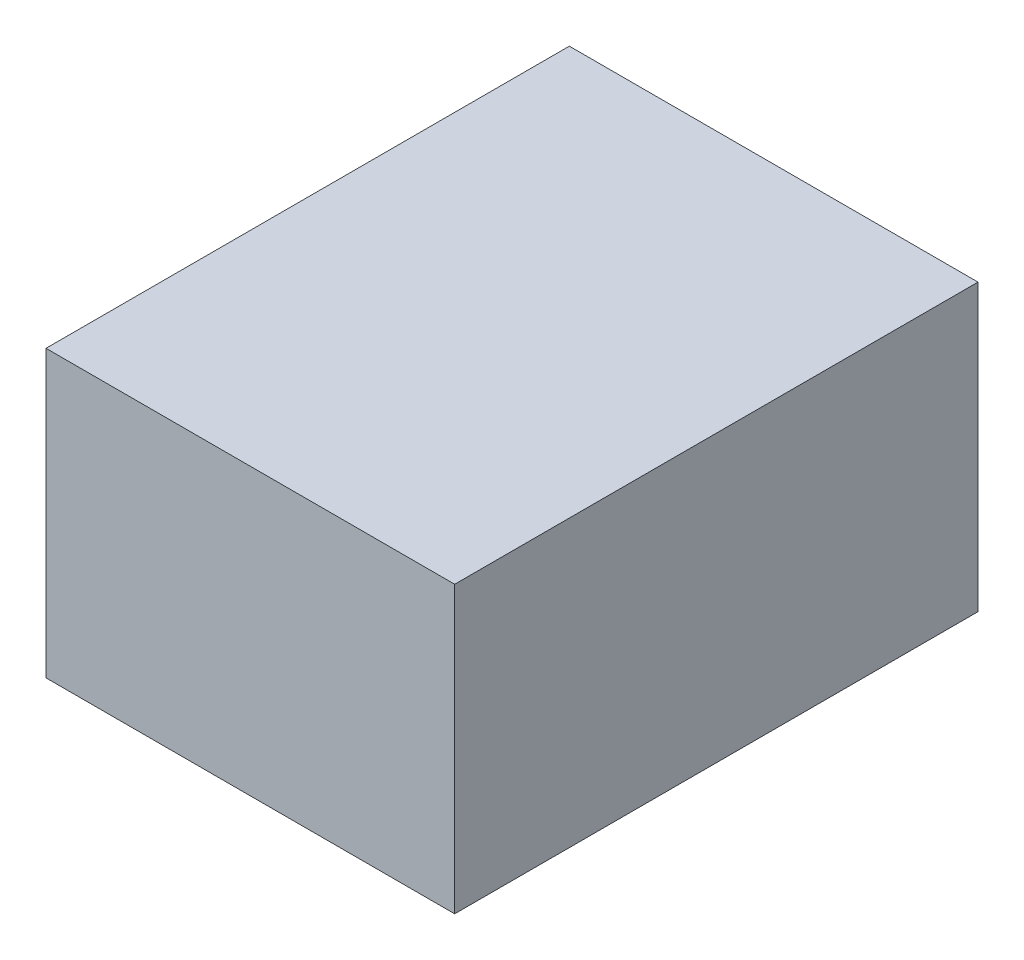
ISO-10303-21;
HEADER;
FILE_DESCRIPTION(('STEP AP214'),'2;1');
FILE_NAME('part.step','',(''),(''),'','','');
FILE_SCHEMA(('AUTOMOTIVE_DESIGN { 1 0 10303 214 1 1 1 1 }'));
ENDSEC;
DATA;
#1=APPLICATION_CONTEXT('core data for automotive mechanical design processes');
#2=APPLICATION_PROTOCOL_DEFINITION('international standard','automotive_design',2000,#1);
#3=PRODUCT_CONTEXT('',#1,'mechanical');
#4=PRODUCT('Part','Part','',(#3));
#5=PRODUCT_RELATED_PRODUCT_CATEGORY('part','',(#4));
#6=PRODUCT_DEFINITION_FORMATION('','',#4);
#7=PRODUCT_DEFINITION_CONTEXT('part definition',#1,'design');
#8=PRODUCT_DEFINITION('design','',#6,#7);
#9=PRODUCT_DEFINITION_SHAPE('','',#8);
#10=(LENGTH_UNIT() NAMED_UNIT(*) SI_UNIT(.MILLI.,.METRE.));
#11=(NAMED_UNIT(*) PLANE_ANGLE_UNIT() SI_UNIT($,.RADIAN.));
#12=(NAMED_UNIT(*) SI_UNIT($,.STERADIAN.) SOLID_ANGLE_UNIT());
#13=UNCERTAINTY_MEASURE_WITH_UNIT(LENGTH_MEASURE(1.E-05),#10,'distance_accuracy_value','');
#14=(GEOMETRIC_REPRESENTATION_CONTEXT(3) GLOBAL_UNCERTAINTY_ASSIGNED_CONTEXT((#13)) GLOBAL_UNIT_ASSIGNED_CONTEXT((#10,
#11,#12)) REPRESENTATION_CONTEXT('',''));
#15=CARTESIAN_POINT('',(0.,0.,0.));
#16=DIRECTION('',(0.,0.,1.));
#17=DIRECTION('',(1.,0.,0.));
#18=AXIS2_PLACEMENT_3D('',#15,#16,#17);
#19=CARTESIAN_POINT('',(0.,0.,22.));
#20=DIRECTION('',(1.,0.,0.));
#21=DIRECTION('',(0.,0.,-1.));
#22=AXIS2_PLACEMENT_3D('',#19,#20,#21);
#23=PLANE('',#22);
#24=DIRECTION('',(0.,-1.,0.));
#25=VECTOR('',#24,1.);
#26=CARTESIAN_POINT('',(0.,0.,0.));
#27=LINE('',#26,#25);
#28=CARTESIAN_POINT('',(0.,12.,0.));
#29=VERTEX_POINT('',#28);
#30=CARTESIAN_POINT('',(0.,0.,0.));
#31=VERTEX_POINT('',#30);
#32=EDGE_CURVE('E96',#29,#31,#27,.T.);
#33=ORIENTED_EDGE('',*,*,#32,.T.);
#34=DIRECTION('',(0.,0.,-1.));
#35=VECTOR('',#34,1.);
#36=CARTESIAN_POINT('',(0.,0.,22.));
#37=LINE('',#36,#35);
#38=CARTESIAN_POINT('',(0.,0.,22.));
#39=VERTEX_POINT('',#38);
#40=EDGE_CURVE('E11',#39,#31,#37,.T.);
#41=ORIENTED_EDGE('',*,*,#40,.F.);
#42=DIRECTION('',(0.,-1.,0.));
#43=VECTOR('',#42,1.);
#44=CARTESIAN_POINT('',(0.,0.,22.));
#45=LINE('',#44,#43);
#46=CARTESIAN_POINT('',(0.,12.,22.));
#47=VERTEX_POINT('',#46);
#48=EDGE_CURVE('E84',#47,#39,#45,.T.);
#49=ORIENTED_EDGE('',*,*,#48,.F.);
#50=DIRECTION('',(0.,0.,-1.));
#51=VECTOR('',#50,1.);
#52=CARTESIAN_POINT('',(0.,12.,22.));
#53=LINE('',#52,#51);
#54=EDGE_CURVE('E92',#47,#29,#53,.T.);
#55=ORIENTED_EDGE('',*,*,#54,.T.);
#56=EDGE_LOOP('',(#33,#41,#49,#55));
#57=FACE_BOUND('',#56,.T.);
#58=ADVANCED_FACE('F33',(#57),#23,.F.);
#59=CARTESIAN_POINT('',(0.,0.,22.));
#60=DIRECTION('',(0.,1.,0.));
#61=DIRECTION('',(0.,0.,1.));
#62=AXIS2_PLACEMENT_3D('',#59,#60,#61);
#63=PLANE('',#62);
#64=DIRECTION('',(1.,0.,0.));
#65=VECTOR('',#64,1.);
#66=CARTESIAN_POINT('',(0.,0.,0.));
#67=LINE('',#66,#65);
#68=CARTESIAN_POINT('',(17.18,0.,0.));
#69=VERTEX_POINT('',#68);
#70=EDGE_CURVE('E88',#31,#69,#67,.T.);
#71=ORIENTED_EDGE('',*,*,#70,.T.);
#72=DIRECTION('',(0.,0.,-1.));
#73=VECTOR('',#72,1.);
#74=CARTESIAN_POINT('',(17.18,0.,22.));
#75=LINE('',#74,#73);
#76=CARTESIAN_POINT('',(17.18,0.,22.));
#77=VERTEX_POINT('',#76);
#78=EDGE_CURVE('E41',#77,#69,#75,.T.);
#79=ORIENTED_EDGE('',*,*,#78,.F.);
#80=DIRECTION('',(1.,0.,0.));
#81=VECTOR('',#80,1.);
#82=CARTESIAN_POINT('',(0.,0.,22.));
#83=LINE('',#82,#81);
#84=EDGE_CURVE('E79',#39,#77,#83,.T.);
#85=ORIENTED_EDGE('',*,*,#84,.F.);
#86=ORIENTED_EDGE('',*,*,#40,.T.);
#87=EDGE_LOOP('',(#71,#79,#85,#86));
#88=FACE_BOUND('',#87,.T.);
#89=ADVANCED_FACE('F87',(#88),#63,.F.);
#90=CARTESIAN_POINT('',(17.18,0.,22.));
#91=DIRECTION('',(-1.,0.,0.));
#92=DIRECTION('',(0.,0.,1.));
#93=AXIS2_PLACEMENT_3D('',#90,#91,#92);
#94=PLANE('',#93);
#95=DIRECTION('',(0.,1.,0.));
#96=VECTOR('',#95,1.);
#97=CARTESIAN_POINT('',(17.18,0.,0.));
#98=LINE('',#97,#96);
#99=CARTESIAN_POINT('',(17.18,12.,0.));
#100=VERTEX_POINT('',#99);
#101=EDGE_CURVE('E66',#69,#100,#98,.T.);
#102=ORIENTED_EDGE('',*,*,#101,.T.);
#103=DIRECTION('',(0.,0.,-1.));
#104=VECTOR('',#103,1.);
#105=CARTESIAN_POINT('',(17.18,12.,22.));
#106=LINE('',#105,#104);
#107=CARTESIAN_POINT('',(17.18,12.,22.));
#108=VERTEX_POINT('',#107);
#109=EDGE_CURVE('E89',#108,#100,#106,.T.);
#110=ORIENTED_EDGE('',*,*,#109,.F.);
#111=DIRECTION('',(0.,1.,0.));
#112=VECTOR('',#111,1.);
#113=CARTESIAN_POINT('',(17.18,0.,22.));
#114=LINE('',#113,#112);
#115=EDGE_CURVE('E82',#77,#108,#114,.T.);
#116=ORIENTED_EDGE('',*,*,#115,.F.);
#117=ORIENTED_EDGE('',*,*,#78,.T.);
#118=EDGE_LOOP('',(#102,#110,#116,#117));
#119=FACE_BOUND('',#118,.T.);
#120=ADVANCED_FACE('F90',(#119),#94,.F.);
#121=CARTESIAN_POINT('',(0.,12.,22.));
#122=DIRECTION('',(0.,-1.,0.));
#123=DIRECTION('',(1.,0.,0.));
#124=AXIS2_PLACEMENT_3D('',#121,#122,#123);
#125=PLANE('',#124);
#126=DIRECTION('',(-1.,0.,0.));
#127=VECTOR('',#126,1.);
#128=CARTESIAN_POINT('',(0.,12.,0.));
#129=LINE('',#128,#127);
#130=EDGE_CURVE('E72',#100,#29,#129,.T.);
#131=ORIENTED_EDGE('',*,*,#130,.T.);
#132=ORIENTED_EDGE('',*,*,#54,.F.);
#133=DIRECTION('',(-1.,0.,0.));
#134=VECTOR('',#133,1.);
#135=CARTESIAN_POINT('',(0.,12.,22.));
#136=LINE('',#135,#134);
#137=EDGE_CURVE('E49',#108,#47,#136,.T.);
#138=ORIENTED_EDGE('',*,*,#137,.F.);
#139=ORIENTED_EDGE('',*,*,#109,.T.);
#140=EDGE_LOOP('',(#131,#132,#138,#139));
#141=FACE_BOUND('',#140,.T.);
#142=ADVANCED_FACE('F103',(#141),#125,.F.);
#143=CARTESIAN_POINT('',(0.,12.,22.));
#144=DIRECTION('',(0.,0.,-1.));
#145=DIRECTION('',(-1.,0.,0.));
#146=AXIS2_PLACEMENT_3D('',#143,#144,#145);
#147=PLANE('',#146);
#148=ORIENTED_EDGE('',*,*,#48,.T.);
#149=ORIENTED_EDGE('',*,*,#84,.T.);
#150=ORIENTED_EDGE('',*,*,#115,.T.);
#151=ORIENTED_EDGE('',*,*,#137,.T.);
#152=EDGE_LOOP('',(#148,#149,#150,#151));
#153=FACE_BOUND('',#152,.T.);
#154=ADVANCED_FACE('F80',(#153),#147,.F.);
#155=CARTESIAN_POINT('',(0.,12.,0.));
#156=DIRECTION('',(0.,0.,-1.));
#157=DIRECTION('',(-1.,0.,0.));
#158=AXIS2_PLACEMENT_3D('',#155,#156,#157);
#159=PLANE('',#158);
#160=ORIENTED_EDGE('',*,*,#32,.F.);
#161=ORIENTED_EDGE('',*,*,#130,.F.);
#162=ORIENTED_EDGE('',*,*,#101,.F.);
#163=ORIENTED_EDGE('',*,*,#70,.F.);
#164=EDGE_LOOP('',(#160,#161,#162,#163));
#165=FACE_BOUND('',#164,.T.);
#166=ADVANCED_FACE('F106',(#165),#159,.T.);
#167=CLOSED_SHELL('',(#58,#89,#120,#142,#154,#166));
#168=MANIFOLD_SOLID_BREP('B2',#167);
#169=ADVANCED_BREP_SHAPE_REPRESENTATION('',(#18,#168),#14);
#170=SHAPE_DEFINITION_REPRESENTATION(#9,#169);
ENDSEC;
END-ISO-10303-21;
